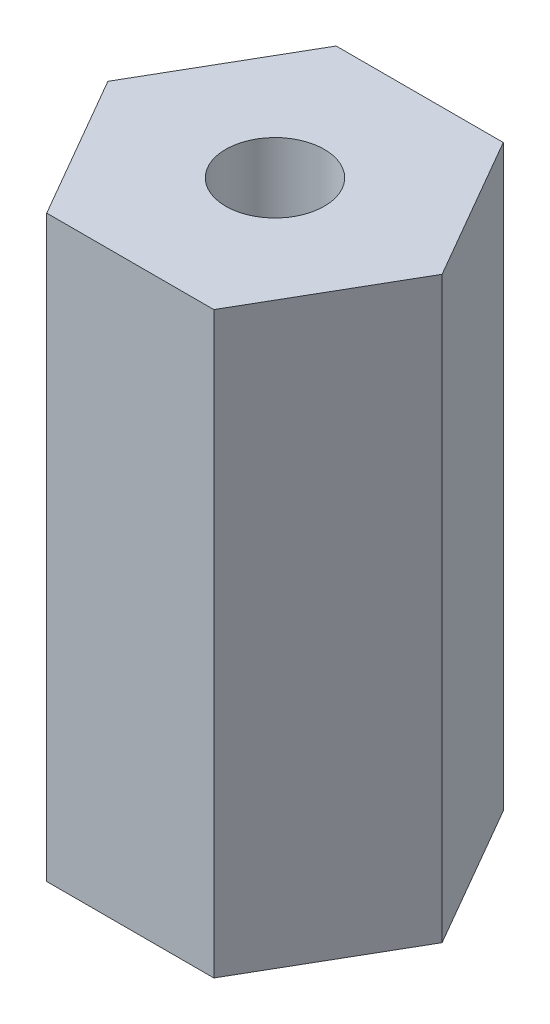
ISO-10303-21;
HEADER;
FILE_DESCRIPTION(('STEP AP214'),'2;1');
FILE_NAME('part.step','',(''),(''),'','','');
FILE_SCHEMA(('AUTOMOTIVE_DESIGN { 1 0 10303 214 1 1 1 1 }'));
ENDSEC;
DATA;
#1=APPLICATION_CONTEXT('core data for automotive mechanical design processes');
#2=APPLICATION_PROTOCOL_DEFINITION('international standard','automotive_design',2000,#1);
#3=PRODUCT_CONTEXT('',#1,'mechanical');
#4=PRODUCT('Part','Part','',(#3));
#5=PRODUCT_RELATED_PRODUCT_CATEGORY('part','',(#4));
#6=PRODUCT_DEFINITION_FORMATION('','',#4);
#7=PRODUCT_DEFINITION_CONTEXT('part definition',#1,'design');
#8=PRODUCT_DEFINITION('design','',#6,#7);
#9=PRODUCT_DEFINITION_SHAPE('','',#8);
#10=(LENGTH_UNIT() NAMED_UNIT(*) SI_UNIT(.MILLI.,.METRE.));
#11=(NAMED_UNIT(*) PLANE_ANGLE_UNIT() SI_UNIT($,.RADIAN.));
#12=(NAMED_UNIT(*) SI_UNIT($,.STERADIAN.) SOLID_ANGLE_UNIT());
#13=UNCERTAINTY_MEASURE_WITH_UNIT(LENGTH_MEASURE(1.E-05),#10,'distance_accuracy_value','');
#14=(GEOMETRIC_REPRESENTATION_CONTEXT(3) GLOBAL_UNCERTAINTY_ASSIGNED_CONTEXT((#13)) GLOBAL_UNIT_ASSIGNED_CONTEXT((#10,
#11,#12)) REPRESENTATION_CONTEXT('',''));
#15=CARTESIAN_POINT('',(0.,0.,0.));
#16=DIRECTION('',(0.,0.,1.));
#17=DIRECTION('',(1.,0.,0.));
#18=AXIS2_PLACEMENT_3D('',#15,#16,#17);
#19=CARTESIAN_POINT('',(2.29135888084638,15.875,3.96874999999998));
#20=DIRECTION('',(-0.866025403784442,0.,-0.499999999999995));
#21=DIRECTION('',(-0.499999999999995,0.,0.866025403784442));
#22=AXIS2_PLACEMENT_3D('',#19,#20,#21);
#23=PLANE('',#22);
#24=DIRECTION('',(0.499999999999995,0.,-0.866025403784442));
#25=VECTOR('',#24,1.);
#26=CARTESIAN_POINT('',(2.29135888084638,0.,3.96874999999998));
#27=LINE('',#26,#25);
#28=CARTESIAN_POINT('',(2.29135888084638,0.,3.96874999999998));
#29=VERTEX_POINT('',#28);
#30=CARTESIAN_POINT('',(4.58271776169266,0.,0.));
#31=VERTEX_POINT('',#30);
#32=EDGE_CURVE('E123',#29,#31,#27,.T.);
#33=ORIENTED_EDGE('',*,*,#32,.T.);
#34=DIRECTION('',(0.,-1.,0.));
#35=VECTOR('',#34,1.);
#36=CARTESIAN_POINT('',(4.58271776169266,15.875,0.));
#37=LINE('',#36,#35);
#38=CARTESIAN_POINT('',(4.58271776169266,15.875,0.));
#39=VERTEX_POINT('',#38);
#40=EDGE_CURVE('E11',#39,#31,#37,.T.);
#41=ORIENTED_EDGE('',*,*,#40,.F.);
#42=DIRECTION('',(0.499999999999995,0.,-0.866025403784442));
#43=VECTOR('',#42,1.);
#44=CARTESIAN_POINT('',(2.29135888084638,15.875,3.96874999999998));
#45=LINE('',#44,#43);
#46=CARTESIAN_POINT('',(2.29135888084638,15.875,3.96874999999998));
#47=VERTEX_POINT('',#46);
#48=EDGE_CURVE('E134',#47,#39,#45,.T.);
#49=ORIENTED_EDGE('',*,*,#48,.F.);
#50=DIRECTION('',(0.,-1.,0.));
#51=VECTOR('',#50,1.);
#52=CARTESIAN_POINT('',(2.29135888084638,15.875,3.96874999999998));
#53=LINE('',#52,#51);
#54=EDGE_CURVE('E119',#47,#29,#53,.T.);
#55=ORIENTED_EDGE('',*,*,#54,.T.);
#56=EDGE_LOOP('',(#33,#41,#49,#55));
#57=FACE_BOUND('',#56,.T.);
#58=ADVANCED_FACE('F36',(#57),#23,.F.);
#59=CARTESIAN_POINT('',(4.58271776169266,15.875,0.));
#60=DIRECTION('',(-0.866025403784438,0.,0.500000000000001));
#61=DIRECTION('',(0.500000000000001,0.,0.866025403784438));
#62=AXIS2_PLACEMENT_3D('',#59,#60,#61);
#63=PLANE('',#62);
#64=DIRECTION('',(-0.500000000000001,0.,-0.866025403784438));
#65=VECTOR('',#64,1.);
#66=CARTESIAN_POINT('',(4.58271776169266,0.,0.));
#67=LINE('',#66,#65);
#68=CARTESIAN_POINT('',(2.29135888084632,0.,-3.96875000000001));
#69=VERTEX_POINT('',#68);
#70=EDGE_CURVE('E126',#31,#69,#67,.T.);
#71=ORIENTED_EDGE('',*,*,#70,.T.);
#72=DIRECTION('',(0.,-1.,0.));
#73=VECTOR('',#72,1.);
#74=CARTESIAN_POINT('',(2.29135888084632,15.875,-3.96875000000001));
#75=LINE('',#74,#73);
#76=CARTESIAN_POINT('',(2.29135888084632,15.875,-3.96875000000001));
#77=VERTEX_POINT('',#76);
#78=EDGE_CURVE('E44',#77,#69,#75,.T.);
#79=ORIENTED_EDGE('',*,*,#78,.F.);
#80=DIRECTION('',(-0.500000000000001,0.,-0.866025403784438));
#81=VECTOR('',#80,1.);
#82=CARTESIAN_POINT('',(4.58271776169266,15.875,0.));
#83=LINE('',#82,#81);
#84=EDGE_CURVE('E90',#39,#77,#83,.T.);
#85=ORIENTED_EDGE('',*,*,#84,.F.);
#86=ORIENTED_EDGE('',*,*,#40,.T.);
#87=EDGE_LOOP('',(#71,#79,#85,#86));
#88=FACE_BOUND('',#87,.T.);
#89=ADVANCED_FACE('F159',(#88),#63,.F.);
#90=CARTESIAN_POINT('',(2.29135888084632,15.875,-3.96875000000001));
#91=DIRECTION('',(0.,0.,1.));
#92=DIRECTION('',(1.,0.,0.));
#93=AXIS2_PLACEMENT_3D('',#90,#91,#92);
#94=PLANE('',#93);
#95=DIRECTION('',(-1.,0.,0.));
#96=VECTOR('',#95,1.);
#97=CARTESIAN_POINT('',(2.29135888084632,0.,-3.96875000000001));
#98=LINE('',#97,#96);
#99=CARTESIAN_POINT('',(-2.29135888084635,0.,-3.96874999999999));
#100=VERTEX_POINT('',#99);
#101=EDGE_CURVE('E129',#69,#100,#98,.T.);
#102=ORIENTED_EDGE('',*,*,#101,.T.);
#103=DIRECTION('',(0.,-1.,0.));
#104=VECTOR('',#103,1.);
#105=CARTESIAN_POINT('',(-2.29135888084635,15.875,-3.96874999999999));
#106=LINE('',#105,#104);
#107=CARTESIAN_POINT('',(-2.29135888084635,15.875,-3.96874999999999));
#108=VERTEX_POINT('',#107);
#109=EDGE_CURVE('E114',#108,#100,#106,.T.);
#110=ORIENTED_EDGE('',*,*,#109,.F.);
#111=DIRECTION('',(-1.,0.,0.));
#112=VECTOR('',#111,1.);
#113=CARTESIAN_POINT('',(2.29135888084632,15.875,-3.96875000000001));
#114=LINE('',#113,#112);
#115=EDGE_CURVE('E105',#77,#108,#114,.T.);
#116=ORIENTED_EDGE('',*,*,#115,.F.);
#117=ORIENTED_EDGE('',*,*,#78,.T.);
#118=EDGE_LOOP('',(#102,#110,#116,#117));
#119=FACE_BOUND('',#118,.T.);
#120=ADVANCED_FACE('F140',(#119),#94,.F.);
#121=CARTESIAN_POINT('',(-2.29135888084635,15.875,-3.96874999999999));
#122=DIRECTION('',(0.866025403784441,0.,0.499999999999995));
#123=DIRECTION('',(0.499999999999995,0.,-0.866025403784441));
#124=AXIS2_PLACEMENT_3D('',#121,#122,#123);
#125=PLANE('',#124);
#126=DIRECTION('',(-0.499999999999995,0.,0.866025403784441));
#127=VECTOR('',#126,1.);
#128=CARTESIAN_POINT('',(-2.29135888084635,0.,-3.96874999999999));
#129=LINE('',#128,#127);
#130=CARTESIAN_POINT('',(-4.58271776169266,0.,0.));
#131=VERTEX_POINT('',#130);
#132=EDGE_CURVE('E113',#100,#131,#129,.T.);
#133=ORIENTED_EDGE('',*,*,#132,.T.);
#134=DIRECTION('',(0.,-1.,0.));
#135=VECTOR('',#134,1.);
#136=CARTESIAN_POINT('',(-4.58271776169266,15.875,0.));
#137=LINE('',#136,#135);
#138=CARTESIAN_POINT('',(-4.58271776169266,15.875,0.));
#139=VERTEX_POINT('',#138);
#140=EDGE_CURVE('E110',#139,#131,#137,.T.);
#141=ORIENTED_EDGE('',*,*,#140,.F.);
#142=DIRECTION('',(-0.499999999999995,0.,0.866025403784441));
#143=VECTOR('',#142,1.);
#144=CARTESIAN_POINT('',(-2.29135888084635,15.875,-3.96874999999999));
#145=LINE('',#144,#143);
#146=EDGE_CURVE('E99',#108,#139,#145,.T.);
#147=ORIENTED_EDGE('',*,*,#146,.F.);
#148=ORIENTED_EDGE('',*,*,#109,.T.);
#149=EDGE_LOOP('',(#133,#141,#147,#148));
#150=FACE_BOUND('',#149,.T.);
#151=ADVANCED_FACE('F111',(#150),#125,.F.);
#152=CARTESIAN_POINT('',(-4.58271776169266,15.875,0.));
#153=DIRECTION('',(0.866025403784435,0.,-0.500000000000007));
#154=DIRECTION('',(-0.500000000000007,0.,-0.866025403784435));
#155=AXIS2_PLACEMENT_3D('',#152,#153,#154);
#156=PLANE('',#155);
#157=DIRECTION('',(0.500000000000007,0.,0.866025403784435));
#158=VECTOR('',#157,1.);
#159=CARTESIAN_POINT('',(-4.58271776169266,0.,0.));
#160=LINE('',#159,#158);
#161=CARTESIAN_POINT('',(-2.29135888084629,0.,3.96875000000003));
#162=VERTEX_POINT('',#161);
#163=EDGE_CURVE('E76',#131,#162,#160,.T.);
#164=ORIENTED_EDGE('',*,*,#163,.T.);
#165=DIRECTION('',(0.,-1.,0.));
#166=VECTOR('',#165,1.);
#167=CARTESIAN_POINT('',(-2.29135888084629,15.875,3.96875000000003));
#168=LINE('',#167,#166);
#169=CARTESIAN_POINT('',(-2.29135888084629,15.875,3.96875000000003));
#170=VERTEX_POINT('',#169);
#171=EDGE_CURVE('E115',#170,#162,#168,.T.);
#172=ORIENTED_EDGE('',*,*,#171,.F.);
#173=DIRECTION('',(0.500000000000007,0.,0.866025403784435));
#174=VECTOR('',#173,1.);
#175=CARTESIAN_POINT('',(-4.58271776169266,15.875,0.));
#176=LINE('',#175,#174);
#177=EDGE_CURVE('E103',#139,#170,#176,.T.);
#178=ORIENTED_EDGE('',*,*,#177,.F.);
#179=ORIENTED_EDGE('',*,*,#140,.T.);
#180=EDGE_LOOP('',(#164,#172,#178,#179));
#181=FACE_BOUND('',#180,.T.);
#182=ADVANCED_FACE('F117',(#181),#156,.F.);
#183=CARTESIAN_POINT('',(-2.29135888084629,15.875,3.96875000000003));
#184=DIRECTION('',(0.,0.,-1.));
#185=DIRECTION('',(-1.,0.,0.));
#186=AXIS2_PLACEMENT_3D('',#183,#184,#185);
#187=PLANE('',#186);
#188=DIRECTION('',(1.,0.,0.));
#189=VECTOR('',#188,1.);
#190=CARTESIAN_POINT('',(-2.29135888084629,0.,3.96875000000003));
#191=LINE('',#190,#189);
#192=EDGE_CURVE('E82',#162,#29,#191,.T.);
#193=ORIENTED_EDGE('',*,*,#192,.T.);
#194=ORIENTED_EDGE('',*,*,#54,.F.);
#195=DIRECTION('',(1.,0.,0.));
#196=VECTOR('',#195,1.);
#197=CARTESIAN_POINT('',(-2.29135888084629,15.875,3.96875000000003));
#198=LINE('',#197,#196);
#199=EDGE_CURVE('E52',#170,#47,#198,.T.);
#200=ORIENTED_EDGE('',*,*,#199,.F.);
#201=ORIENTED_EDGE('',*,*,#171,.T.);
#202=EDGE_LOOP('',(#193,#194,#200,#201));
#203=FACE_BOUND('',#202,.T.);
#204=ADVANCED_FACE('F147',(#203),#187,.F.);
#205=CARTESIAN_POINT('',(0.,15.875,0.));
#206=DIRECTION('',(0.,1.,0.));
#207=DIRECTION('',(0.,0.,1.));
#208=AXIS2_PLACEMENT_3D('',#205,#206,#207);
#209=PLANE('',#208);
#210=CARTESIAN_POINT('',(0.,15.875,0.));
#211=DIRECTION('',(0.,1.,0.));
#212=DIRECTION('',(0.,0.,1.));
#213=AXIS2_PLACEMENT_3D('',#210,#211,#212);
#214=CIRCLE('',#213,1.35254999999999);
#215=CARTESIAN_POINT('',(0.,15.875,1.35254999999999));
#216=VERTEX_POINT('',#215);
#217=EDGE_CURVE('E253',#216,#216,#214,.T.);
#218=ORIENTED_EDGE('',*,*,#217,.F.);
#219=EDGE_LOOP('',(#218));
#220=FACE_BOUND('',#219,.T.);
#221=ORIENTED_EDGE('',*,*,#48,.T.);
#222=ORIENTED_EDGE('',*,*,#84,.T.);
#223=ORIENTED_EDGE('',*,*,#115,.T.);
#224=ORIENTED_EDGE('',*,*,#146,.T.);
#225=ORIENTED_EDGE('',*,*,#177,.T.);
#226=ORIENTED_EDGE('',*,*,#199,.T.);
#227=EDGE_LOOP('',(#221,#222,#223,#224,#225,#226));
#228=FACE_BOUND('',#227,.T.);
#229=ADVANCED_FACE('F101',(#220,#228),#209,.T.);
#230=CARTESIAN_POINT('',(0.,0.,0.));
#231=DIRECTION('',(0.,1.,0.));
#232=DIRECTION('',(0.,0.,1.));
#233=AXIS2_PLACEMENT_3D('',#230,#231,#232);
#234=PLANE('',#233);
#235=CARTESIAN_POINT('',(0.,0.,0.));
#236=DIRECTION('',(0.,-1.,0.));
#237=DIRECTION('',(0.,0.,-1.));
#238=AXIS2_PLACEMENT_3D('',#235,#236,#237);
#239=CIRCLE('',#238,1.35254999999999);
#240=CARTESIAN_POINT('',(0.,0.,-1.35254999999999));
#241=VERTEX_POINT('',#240);
#242=EDGE_CURVE('E255',#241,#241,#239,.T.);
#243=ORIENTED_EDGE('',*,*,#242,.F.);
#244=EDGE_LOOP('',(#243));
#245=FACE_BOUND('',#244,.T.);
#246=ORIENTED_EDGE('',*,*,#32,.F.);
#247=ORIENTED_EDGE('',*,*,#192,.F.);
#248=ORIENTED_EDGE('',*,*,#163,.F.);
#249=ORIENTED_EDGE('',*,*,#132,.F.);
#250=ORIENTED_EDGE('',*,*,#101,.F.);
#251=ORIENTED_EDGE('',*,*,#70,.F.);
#252=EDGE_LOOP('',(#246,#247,#248,#249,#250,#251));
#253=FACE_BOUND('',#252,.T.);
#254=ADVANCED_FACE('F143',(#245,#253),#234,.F.);
#255=CARTESIAN_POINT('',(0.,5.08,0.));
#256=DIRECTION('',(0.,-1.,0.));
#257=DIRECTION('',(0.,0.,-1.));
#258=AXIS2_PLACEMENT_3D('',#255,#256,#257);
#259=CONICAL_SURFACE('',#258,1.35255,1.02974425867665);
#260=CARTESIAN_POINT('',(0.,5.89269403026573,0.));
#261=VERTEX_POINT('',#260);
#262=VERTEX_LOOP('',#261);
#263=FACE_BOUND('',#262,.T.);
#264=CARTESIAN_POINT('',(0.,5.08,0.));
#265=DIRECTION('',(0.,-1.,0.));
#266=DIRECTION('',(0.,0.,-1.));
#267=AXIS2_PLACEMENT_3D('',#264,#265,#266);
#268=CIRCLE('',#267,1.35255);
#269=CARTESIAN_POINT('',(0.,5.08,-1.35255));
#270=VERTEX_POINT('',#269);
#271=EDGE_CURVE('E127',#270,#270,#268,.T.);
#272=ORIENTED_EDGE('',*,*,#271,.T.);
#273=EDGE_LOOP('',(#272));
#274=FACE_BOUND('',#273,.T.);
#275=ADVANCED_FACE('F191',(#263,#274),#259,.F.);
#276=CARTESIAN_POINT('',(0.,0.,0.));
#277=DIRECTION('',(0.,-1.,0.));
#278=DIRECTION('',(0.,0.,-1.));
#279=AXIS2_PLACEMENT_3D('',#276,#277,#278);
#280=CYLINDRICAL_SURFACE('',#279,1.35254999999999);
#281=ORIENTED_EDGE('',*,*,#271,.F.);
#282=EDGE_LOOP('',(#281));
#283=FACE_BOUND('',#282,.T.);
#284=ORIENTED_EDGE('',*,*,#242,.T.);
#285=EDGE_LOOP('',(#284));
#286=FACE_BOUND('',#285,.T.);
#287=ADVANCED_FACE('F200',(#283,#286),#280,.F.);
#288=CARTESIAN_POINT('',(0.,10.795,0.));
#289=DIRECTION('',(0.,1.,0.));
#290=DIRECTION('',(0.,0.,1.));
#291=AXIS2_PLACEMENT_3D('',#288,#289,#290);
#292=CONICAL_SURFACE('',#291,1.35255,1.02974425867665);
#293=CARTESIAN_POINT('',(0.,9.98230596973427,0.));
#294=VERTEX_POINT('',#293);
#295=VERTEX_LOOP('',#294);
#296=FACE_BOUND('',#295,.T.);
#297=CARTESIAN_POINT('',(0.,10.795,0.));
#298=DIRECTION('',(0.,1.,0.));
#299=DIRECTION('',(0.,0.,1.));
#300=AXIS2_PLACEMENT_3D('',#297,#298,#299);
#301=CIRCLE('',#300,1.35255);
#302=CARTESIAN_POINT('',(0.,10.795,1.35255));
#303=VERTEX_POINT('',#302);
#304=EDGE_CURVE('E250',#303,#303,#301,.T.);
#305=ORIENTED_EDGE('',*,*,#304,.T.);
#306=EDGE_LOOP('',(#305));
#307=FACE_BOUND('',#306,.T.);
#308=ADVANCED_FACE('F211',(#296,#307),#292,.F.);
#309=CARTESIAN_POINT('',(0.,15.875,0.));
#310=DIRECTION('',(0.,1.,0.));
#311=DIRECTION('',(0.,0.,1.));
#312=AXIS2_PLACEMENT_3D('',#309,#310,#311);
#313=CYLINDRICAL_SURFACE('',#312,1.35254999999999);
#314=ORIENTED_EDGE('',*,*,#304,.F.);
#315=EDGE_LOOP('',(#314));
#316=FACE_BOUND('',#315,.T.);
#317=ORIENTED_EDGE('',*,*,#217,.T.);
#318=EDGE_LOOP('',(#317));
#319=FACE_BOUND('',#318,.T.);
#320=ADVANCED_FACE('F228',(#316,#319),#313,.F.);
#321=CLOSED_SHELL('',(#58,#89,#120,#151,#182,#204,#229,#254,#275,#287,#308,#320));
#322=MANIFOLD_SOLID_BREP('B2',#321);
#323=ADVANCED_BREP_SHAPE_REPRESENTATION('',(#18,#322),#14);
#324=SHAPE_DEFINITION_REPRESENTATION(#9,#323);
ENDSEC;
END-ISO-10303-21;
